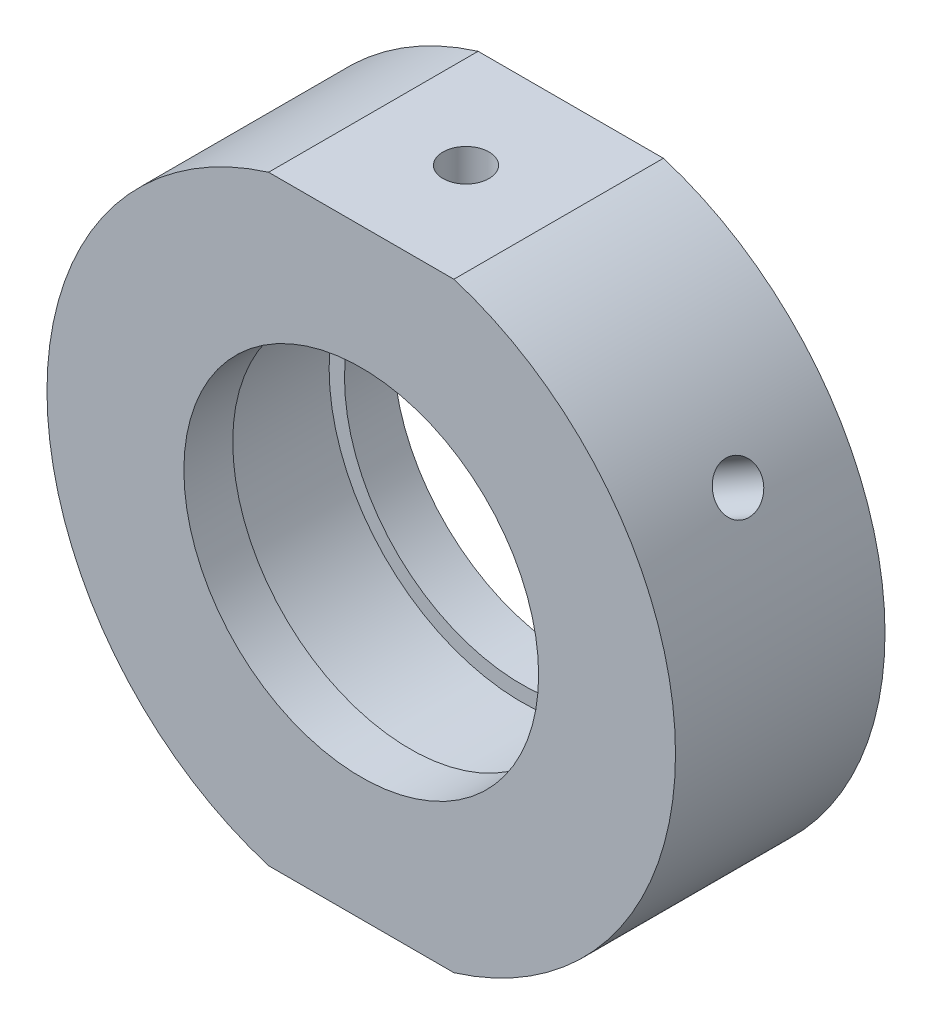
ISO-10303-21;
HEADER;
FILE_DESCRIPTION(('STEP AP214'),'2;1');
FILE_NAME('part.step','',(''),(''),'','','');
FILE_SCHEMA(('AUTOMOTIVE_DESIGN { 1 0 10303 214 1 1 1 1 }'));
ENDSEC;
DATA;
#1=APPLICATION_CONTEXT('core data for automotive mechanical design processes');
#2=APPLICATION_PROTOCOL_DEFINITION('international standard','automotive_design',2000,#1);
#3=PRODUCT_CONTEXT('',#1,'mechanical');
#4=PRODUCT('Part','Part','',(#3));
#5=PRODUCT_RELATED_PRODUCT_CATEGORY('part','',(#4));
#6=PRODUCT_DEFINITION_FORMATION('','',#4);
#7=PRODUCT_DEFINITION_CONTEXT('part definition',#1,'design');
#8=PRODUCT_DEFINITION('design','',#6,#7);
#9=PRODUCT_DEFINITION_SHAPE('','',#8);
#10=(LENGTH_UNIT() NAMED_UNIT(*) SI_UNIT(.MILLI.,.METRE.));
#11=(NAMED_UNIT(*) PLANE_ANGLE_UNIT() SI_UNIT($,.RADIAN.));
#12=(NAMED_UNIT(*) SI_UNIT($,.STERADIAN.) SOLID_ANGLE_UNIT());
#13=UNCERTAINTY_MEASURE_WITH_UNIT(LENGTH_MEASURE(1.E-05),#10,'distance_accuracy_value','');
#14=(GEOMETRIC_REPRESENTATION_CONTEXT(3) GLOBAL_UNCERTAINTY_ASSIGNED_CONTEXT((#13)) GLOBAL_UNIT_ASSIGNED_CONTEXT((#10,
#11,#12)) REPRESENTATION_CONTEXT('',''));
#15=CARTESIAN_POINT('',(0.,0.,0.));
#16=DIRECTION('',(0.,0.,1.));
#17=DIRECTION('',(1.,0.,0.));
#18=AXIS2_PLACEMENT_3D('',#15,#16,#17);
#19=CARTESIAN_POINT('',(0.,0.,-31.9390681003584));
#20=DIRECTION('',(0.,0.,-1.));
#21=DIRECTION('',(-1.,0.,0.));
#22=AXIS2_PLACEMENT_3D('',#19,#20,#21);
#23=CYLINDRICAL_SURFACE('',#22,22.5);
#24=CARTESIAN_POINT('',(18.6081064166282,12.6486511370754,0.));
#25=CARTESIAN_POINT('',(18.6081091445684,12.6486480256482,-0.0925474329693969));
#26=CARTESIAN_POINT('',(18.6125138731054,12.6421746060188,-0.185158797993222));
#27=CARTESIAN_POINT('',(18.6299798982569,12.6164211140759,-0.367821778925524));
#28=CARTESIAN_POINT('',(18.6430511412805,12.5971263268431,-0.457870329547935));
#29=CARTESIAN_POINT('',(18.6773484874938,12.5462181514554,-0.632735502702778));
#30=CARTESIAN_POINT('',(18.6985701317453,12.5146114987667,-0.717554956586452));
#31=CARTESIAN_POINT('',(18.7483705133498,12.4398798069712,-0.879593161075862));
#32=CARTESIAN_POINT('',(18.7769476202604,12.3967573204329,-0.956813590875986));
#33=CARTESIAN_POINT('',(18.840477972399,12.2999892619801,-1.10163881703034));
#34=CARTESIAN_POINT('',(18.8754425139885,12.2463250338274,-1.16922619396582));
#35=CARTESIAN_POINT('',(18.9504770478214,12.1298889730782,-1.29271735635595));
#36=CARTESIAN_POINT('',(18.9905472577464,12.0671167521442,-1.34862064338773));
#37=CARTESIAN_POINT('',(19.07446798279,11.9340210276433,-1.44721277784652));
#38=CARTESIAN_POINT('',(19.1183226577038,11.8636891933369,-1.48988684129189));
#39=CARTESIAN_POINT('',(19.2083253709266,11.7174060079341,-1.5607145737147));
#40=CARTESIAN_POINT('',(19.2544733771349,11.6414547354878,-1.58886844587412));
#41=CARTESIAN_POINT('',(19.3475192982386,11.4861513129805,-1.62980725829498));
#42=CARTESIAN_POINT('',(19.3944157002347,11.4068055848838,-1.64261999697985));
#43=CARTESIAN_POINT('',(19.4876355704773,11.2468053630823,-1.6525987260887));
#44=CARTESIAN_POINT('',(19.5339590472064,11.1661508887956,-1.64976494845143));
#45=CARTESIAN_POINT('',(19.6246406113247,11.0059954395026,-1.62855391604838));
#46=CARTESIAN_POINT('',(19.6690023064095,10.9264925447827,-1.61020655797746));
#47=CARTESIAN_POINT('',(19.7546955894407,10.7707894098273,-1.55853561861861));
#48=CARTESIAN_POINT('',(19.7960271541274,10.6945891949455,-1.52521192238447));
#49=CARTESIAN_POINT('',(19.8746995530709,10.5476668656687,-1.44450064779261));
#50=CARTESIAN_POINT('',(19.9120365178796,10.4769500808296,-1.39709959793996));
#51=CARTESIAN_POINT('',(19.9818442622882,10.3431910402597,-1.28958894618785));
#52=CARTESIAN_POINT('',(20.0143149658083,10.2801489045181,-1.22947914563367));
#53=CARTESIAN_POINT('',(20.0737952183103,10.1635156871738,-1.0980886080938));
#54=CARTESIAN_POINT('',(20.100791731849,10.1099472026106,-1.02678190789847));
#55=CARTESIAN_POINT('',(20.1487122328776,10.0141038458676,-0.875112433168419));
#56=CARTESIAN_POINT('',(20.1696362168436,9.97182898024142,-0.794749653378649));
#57=CARTESIAN_POINT('',(20.205038001384,9.89990173888359,-0.627231799011876));
#58=CARTESIAN_POINT('',(20.2195152453322,9.8702504531101,-0.540076138685324));
#59=CARTESIAN_POINT('',(20.2417722885586,9.82452578610739,-0.361454702097415));
#60=CARTESIAN_POINT('',(20.2495521965543,9.80845218447225,-0.269988995826284));
#61=CARTESIAN_POINT('',(20.258274922367,9.79042385713739,-0.0855717453532621));
#62=CARTESIAN_POINT('',(20.2592336113308,9.78843635690037,0.00737584507742665));
#63=CARTESIAN_POINT('',(20.2543401566944,9.79855781161291,0.192318706517118));
#64=CARTESIAN_POINT('',(20.2484880621061,9.81066666512193,0.284313984374369));
#65=CARTESIAN_POINT('',(20.2300801750725,9.84856814906699,0.464637354526802));
#66=CARTESIAN_POINT('',(20.2175318060138,9.87434562647747,0.552969391196749));
#67=CARTESIAN_POINT('',(20.1859477022425,9.93875215344416,0.723580817174414));
#68=CARTESIAN_POINT('',(20.1669118866491,9.97738136322621,0.805860131005674));
#69=CARTESIAN_POINT('',(20.1226460814815,10.0663587744469,0.962197030704582));
#70=CARTESIAN_POINT('',(20.0974047384709,10.1167284469958,1.03623918134707));
#71=CARTESIAN_POINT('',(20.041216547991,10.2275847935208,1.17384423356218));
#72=CARTESIAN_POINT('',(20.0102696242295,10.2880716027774,1.23740699498778));
#73=CARTESIAN_POINT('',(19.9432258782672,10.4174396710959,1.35237226215219));
#74=CARTESIAN_POINT('',(19.9071192959401,10.4863368024656,1.40375121940241));
#75=CARTESIAN_POINT('',(19.8305892755154,10.6303513254849,1.49272907232273));
#76=CARTESIAN_POINT('',(19.7901658721171,10.7054686671345,1.53032807874736));
#77=CARTESIAN_POINT('',(19.7060041346141,10.8596085369863,1.59063802031532));
#78=CARTESIAN_POINT('',(19.6622691299982,10.9386271157728,1.6133636930902));
#79=CARTESIAN_POINT('',(19.5725744712361,11.0983202133646,1.64333006917298));
#80=CARTESIAN_POINT('',(19.5266148487718,11.1789947085778,1.65057099294087));
#81=CARTESIAN_POINT('',(19.4338528524192,11.3394856253427,1.64936000000076));
#82=CARTESIAN_POINT('',(19.3870527086449,11.4193036159577,1.64094485988714));
#83=CARTESIAN_POINT('',(19.2938793172293,11.5760328158076,1.60873708167541));
#84=CARTESIAN_POINT('',(19.2475060702652,11.6529440204321,1.58494441918767));
#85=CARTESIAN_POINT('',(19.1566247729265,11.8017513342008,1.5226658321736));
#86=CARTESIAN_POINT('',(19.1121166695317,11.8736475859431,1.48418032563337));
#87=CARTESIAN_POINT('',(19.026407568677,12.0105096932139,1.3936130634051));
#88=CARTESIAN_POINT('',(18.9852065017649,12.0754756942968,1.34153159334872));
#89=CARTESIAN_POINT('',(18.9074120572343,12.1969254809359,1.22511337740371));
#90=CARTESIAN_POINT('',(18.8708291274807,12.2533900869802,1.16074964197884));
#91=CARTESIAN_POINT('',(18.8036530534932,12.356229828851,1.02163803597587));
#92=CARTESIAN_POINT('',(18.7730613696655,12.402602505008,0.946887641152488));
#93=CARTESIAN_POINT('',(18.7189456282168,12.4841291265489,0.789010610321112));
#94=CARTESIAN_POINT('',(18.6954325517637,12.5192656462871,0.705871224345826));
#95=CARTESIAN_POINT('',(18.6564373501344,12.5773041367646,0.533727595219881));
#96=CARTESIAN_POINT('',(18.6409459029528,12.6002203098041,0.444730295840865));
#97=CARTESIAN_POINT('',(18.6225688134722,12.6273545779087,0.295998114789599));
#98=CARTESIAN_POINT('',(18.6171544845495,12.6353314542287,0.237222396173702));
#99=CARTESIAN_POINT('',(18.609922412802,12.6459807287083,0.118973259243221));
#100=CARTESIAN_POINT('',(18.6081046628031,12.6486531374489,0.0594998423205809));
#101=CARTESIAN_POINT('',(18.6081064166282,12.6486511370754,0.));
#102=B_SPLINE_CURVE_WITH_KNOTS('',3,(#24,#25,#26,#27,#28,#29,#30,#31,#32,#33,#34,#35,#36,#37,
#38,#39,#40,#41,#42,#43,#44,#45,#46,#47,#48,#49,#50,#51,#52,#53,#54,#55,#56,#57,#58,#59,#60,#61,
#62,#63,#64,#65,#66,#67,#68,#69,#70,#71,#72,#73,#74,#75,#76,#77,#78,#79,#80,#81,#82,#83,#84,#85,
#86,#87,#88,#89,#90,#91,#92,#93,#94,#95,#96,#97,#98,#99,#100,#101),.UNSPECIFIED.,.T.,.F.,(4,2,2,
2,2,2,2,2,2,2,2,2,2,2,2,2,2,2,2,2,2,2,2,2,2,2,2,2,2,2,2,2,2,2,2,2,2,2,4),(0.,0.277425071517473,
0.555169091422678,0.832761378506566,1.11029218623785,1.38831865220752,1.66635697588088,
1.9447049033494,2.22304893577176,2.50088783654439,2.77872261873662,3.05602319414026,
3.3333258979145,3.6108948296993,3.88846810057741,4.16669477670939,4.44492161429148,
4.72317246995164,5.00141880869168,5.2790175304976,5.55661425465307,5.83390387672884,
6.1111969559747,6.38900118741266,6.66680913378801,6.9451497206928,7.22348807042255,
7.50155020207246,7.77960837486029,8.05701420466064,8.33442047444348,8.6118188530837,
8.88921140445146,9.16722067860601,9.445297635254,9.7238037805995,10.0019855410231,
10.1803457656965,10.3587056345923),.UNSPECIFIED.);
#103=CARTESIAN_POINT('',(18.6081064166282,12.6486511370754,0.));
#104=VERTEX_POINT('',#103);
#105=EDGE_CURVE('E11',#104,#104,#102,.T.);
#106=ORIENTED_EDGE('',*,*,#105,.T.);
#107=EDGE_LOOP('',(#106));
#108=FACE_BOUND('',#107,.T.);
#109=CARTESIAN_POINT('',(0.,0.,7.49999999999999));
#110=DIRECTION('',(0.,0.,-1.));
#111=DIRECTION('',(-1.,0.,0.));
#112=AXIS2_PLACEMENT_3D('',#109,#110,#111);
#113=CIRCLE('',#112,22.5);
#114=CARTESIAN_POINT('',(6.63324958071081,21.5,7.5));
#115=VERTEX_POINT('',#114);
#116=CARTESIAN_POINT('',(6.63324958071082,-21.5,7.49999999999999));
#117=VERTEX_POINT('',#116);
#118=EDGE_CURVE('E144',#115,#117,#113,.T.);
#119=ORIENTED_EDGE('',*,*,#118,.T.);
#120=DIRECTION('',(0.,0.,-1.));
#121=VECTOR('',#120,1.);
#122=CARTESIAN_POINT('',(6.63324958071083,-21.5,-31.9390681003584));
#123=LINE('',#122,#121);
#124=CARTESIAN_POINT('',(6.6332495807108,-21.5,-7.5));
#125=VERTEX_POINT('',#124);
#126=EDGE_CURVE('E57',#117,#125,#123,.T.);
#127=ORIENTED_EDGE('',*,*,#126,.T.);
#128=CARTESIAN_POINT('',(0.,0.,-7.5));
#129=DIRECTION('',(0.,0.,-1.));
#130=DIRECTION('',(-1.,0.,0.));
#131=AXIS2_PLACEMENT_3D('',#128,#129,#130);
#132=CIRCLE('',#131,22.5);
#133=CARTESIAN_POINT('',(6.63324958071083,21.5,-7.5));
#134=VERTEX_POINT('',#133);
#135=EDGE_CURVE('E148',#134,#125,#132,.T.);
#136=ORIENTED_EDGE('',*,*,#135,.F.);
#137=DIRECTION('',(0.,0.,-1.));
#138=VECTOR('',#137,1.);
#139=CARTESIAN_POINT('',(6.63324958071083,21.5,-31.9390681003584));
#140=LINE('',#139,#138);
#141=EDGE_CURVE('E118',#134,#115,#140,.F.);
#142=ORIENTED_EDGE('',*,*,#141,.T.);
#143=EDGE_LOOP('',(#119,#127,#136,#142));
#144=FACE_BOUND('',#143,.T.);
#145=ADVANCED_FACE('F37',(#108,#144),#23,.T.);
#146=CARTESIAN_POINT('',(12.7,0.,-7.5));
#147=DIRECTION('',(0.,0.,1.));
#148=DIRECTION('',(1.,0.,0.));
#149=AXIS2_PLACEMENT_3D('',#146,#147,#148);
#150=PLANE('',#149);
#151=CARTESIAN_POINT('',(0.,0.,-7.5));
#152=DIRECTION('',(0.,0.,-1.));
#153=DIRECTION('',(-1.,0.,0.));
#154=AXIS2_PLACEMENT_3D('',#151,#152,#153);
#155=CIRCLE('',#154,12.7);
#156=CARTESIAN_POINT('',(-12.7,0.,-7.5));
#157=VERTEX_POINT('',#156);
#158=EDGE_CURVE('E126',#157,#157,#155,.T.);
#159=ORIENTED_EDGE('',*,*,#158,.F.);
#160=EDGE_LOOP('',(#159));
#161=FACE_BOUND('',#160,.T.);
#162=ORIENTED_EDGE('',*,*,#135,.T.);
#163=DIRECTION('',(-1.,0.,0.));
#164=VECTOR('',#163,1.);
#165=CARTESIAN_POINT('',(12.7,-21.5,-7.5));
#166=LINE('',#165,#164);
#167=CARTESIAN_POINT('',(-6.63324958071082,-21.5,-7.5));
#168=VERTEX_POINT('',#167);
#169=EDGE_CURVE('E114',#125,#168,#166,.T.);
#170=ORIENTED_EDGE('',*,*,#169,.T.);
#171=CARTESIAN_POINT('',(-6.6332495807108,21.5,-7.5));
#172=VERTEX_POINT('',#171);
#173=EDGE_CURVE('E147',#168,#172,#132,.T.);
#174=ORIENTED_EDGE('',*,*,#173,.T.);
#175=DIRECTION('',(1.,0.,0.));
#176=VECTOR('',#175,1.);
#177=CARTESIAN_POINT('',(12.7,21.5,-7.5));
#178=LINE('',#177,#176);
#179=EDGE_CURVE('E121',#172,#134,#178,.T.);
#180=ORIENTED_EDGE('',*,*,#179,.T.);
#181=EDGE_LOOP('',(#162,#170,#174,#180));
#182=FACE_BOUND('',#181,.T.);
#183=ADVANCED_FACE('F39',(#161,#182),#150,.F.);
#184=CARTESIAN_POINT('',(-20.2581064166282,9.79076730458677,0.));
#185=CARTESIAN_POINT('',(-20.2581050860233,9.79077122276591,-0.0925474329693969));
#186=CARTESIAN_POINT('',(-20.2547013044435,9.79782253939038,-0.185158797993223));
#187=CARTESIAN_POINT('',(-20.2411311387604,9.82582530684612,-0.367821778925524));
#188=CARTESIAN_POINT('',(-20.230956984368,9.84679272897999,-0.457870329547935));
#189=CARTESIAN_POINT('',(-20.2040178843286,9.90194918977701,-0.632735502702777));
#190=CARTESIAN_POINT('',(-20.1872565422973,9.9361309991532,-0.717554956586451));
#191=CARTESIAN_POINT('',(-20.147437189537,10.0166252406386,-0.879593161075861));
#192=CARTESIAN_POINT('',(-20.1243805741757,10.062934984459,-0.956813590875986));
#193=CARTESIAN_POINT('',(-20.07234215335,10.1663379125488,-1.10163881703034));
#194=CARTESIAN_POINT('',(-20.04334983929,10.2234502078733,-1.16922619396582));
#195=CARTESIAN_POINT('',(-19.9800305196811,10.3466500507084,-1.29271735635595));
#196=CARTESIAN_POINT('',(-19.9457032866627,10.4127379809054,-1.34862064338773));
#197=CARTESIAN_POINT('',(-19.8723993706316,10.5519633229476,-1.44721277784652));
#198=CARTESIAN_POINT('',(-19.8334175528845,10.6251085026509,-1.48988684129189));
#199=CARTESIAN_POINT('',(-19.7517339547905,10.7761947314127,-1.5607145737147));
#200=CARTESIAN_POINT('',(-19.7090322265064,10.8541357133462,-1.58886844587412));
#201=CARTESIAN_POINT('',(-19.6210584778723,11.0123675559942,-1.62980725829498));
#202=CARTESIAN_POINT('',(-19.5757912626568,11.0926538955173,-1.64261999697985));
#203=CARTESIAN_POINT('',(-19.4838369410869,11.2533847821856,-1.6525987260887));
#204=CARTESIAN_POINT('',(-19.4371498557903,11.333829326968,-1.64976494845143));
#205=CARTESIAN_POINT('',(-19.3437919502072,11.4924395897958,-1.62855391604838));
#206=CARTESIAN_POINT('',(-19.2971212712477,11.5706093920541,-1.61020655797746));
#207=CARTESIAN_POINT('',(-19.2051250424431,11.7226735195706,-1.55853561861861));
#208=CARTESIAN_POINT('',(-19.1597995029249,11.7965678120084,-1.52521192238447));
#209=CARTESIAN_POINT('',(-19.0718972328598,11.9381612727084,-1.44450064779261));
#210=CARTESIAN_POINT('',(-19.0293231831195,12.0058544251525,-1.39709959793996));
#211=CARTESIAN_POINT('',(-18.9483883282044,12.1331892254762,-1.28958894618785));
#212=CARTESIAN_POINT('',(-18.9100275889035,12.1928307474742,-1.22947914563367));
#213=CARTESIAN_POINT('',(-18.8387603860092,12.3026587658366,-1.0980886080938));
#214=CARTESIAN_POINT('',(-18.8058669743045,12.3528226746563,-1.02678190789847));
#215=CARTESIAN_POINT('',(-18.7468244430955,12.4422447242806,-0.87511243316842));
#216=CARTESIAN_POINT('',(-18.7206753275046,12.4815028587567,-0.794749653378649));
#217=CARTESIAN_POINT('',(-18.6760854015348,12.5481253241869,-0.627231799011876));
#218=CARTESIAN_POINT('',(-18.6576452567742,12.5754886281096,-0.540076138685325));
#219=CARTESIAN_POINT('',(-18.6291750551834,12.6176261264581,-0.361454702097416));
#220=CARTESIAN_POINT('',(-18.619144861835,12.6324005252391,-0.269988995826284));
#221=CARTESIAN_POINT('',(-18.6078932352816,12.6489687910505,-0.0855717453532622));
#222=CARTESIAN_POINT('',(-18.6066513540682,12.6507927901661,0.00737584507742638));
#223=CARTESIAN_POINT('',(-18.6129700636543,12.6414942067824,0.192318706517118));
#224=CARTESIAN_POINT('',(-18.6205305911097,12.630371717449,0.284313984374369));
#225=CARTESIAN_POINT('',(-18.6441502955304,12.5954792776754,0.464637354526802));
#226=CARTESIAN_POINT('',(-18.660200061284,12.5717233325893,0.552969391196749));
#227=CARTESIAN_POINT('',(-18.700185697921,12.5121674328842,0.723580817174414));
#228=CARTESIAN_POINT('',(-18.7241216671237,12.4763673281076,0.805860131005674));
#229=CARTESIAN_POINT('',(-18.77904546302,12.3935433107031,0.962197030704581));
#230=CARTESIAN_POINT('',(-18.8100462075224,12.3464988301558,1.03623918134707));
#231=CARTESIAN_POINT('',(-18.8779565245438,12.2424102565451,1.17384423356217));
#232=CARTESIAN_POINT('',(-18.9148661760731,12.1853660297703,1.23740699498777));
#233=CARTESIAN_POINT('',(-18.9933803366944,12.0626204084428,1.35237226215219));
#234=CARTESIAN_POINT('',(-19.0349937115448,11.9969026252189,1.40375121940241));
#235=CARTESIAN_POINT('',(-19.1214489367811,11.8586184218693,1.49272907232273));
#236=CARTESIAN_POINT('',(-19.1662907612152,11.7860520567941,1.53032807874736));
#237=CARTESIAN_POINT('',(-19.2576989354914,11.636095919164,1.59063802031532));
#238=CARTESIAN_POINT('',(-19.3042635297835,11.5587110047387,1.6133636930902));
#239=CARTESIAN_POINT('',(-19.397714479726,11.4011866028711,1.64333006917298));
#240=CARTESIAN_POINT('',(-19.4446008307859,11.3210471546621,1.65057099294087));
#241=CARTESIAN_POINT('',(-19.5372090436047,11.1604674509325,1.64936000000076));
#242=CARTESIAN_POINT('',(-19.5829333792692,11.0800283422158,1.64094485988714));
#243=CARTESIAN_POINT('',(-19.6720781521463,10.9209732183681,1.60873708167541));
#244=CARTESIAN_POINT('',(-19.7154985857046,10.842357206129,1.58494441918767));
#245=CARTESIAN_POINT('',(-19.7989288510279,10.6892480370204,1.5226658321736));
#246=CARTESIAN_POINT('',(-19.8389387797762,10.6147547629351,1.48418032563337));
#247=CARTESIAN_POINT('',(-19.9146102910609,10.472097450624,1.3936130634051));
#248=CARTESIAN_POINT('',(-19.9502719649249,10.4039332794737,1.34153159334872));
#249=CARTESIAN_POINT('',(-20.0165533431733,10.2758364209174,1.22511337740371));
#250=CARTESIAN_POINT('',(-20.0471616615455,10.2159223713837,1.16074964197884));
#251=CARTESIAN_POINT('',(-20.1026354535305,10.1063263138487,1.02163803597587));
#252=CARTESIAN_POINT('',(-20.1274995272101,10.0566468004307,0.946887641152488));
#253=CARTESIAN_POINT('',(-20.1710457818249,9.96901788282112,0.789010610321112));
#254=CARTESIAN_POINT('',(-20.1897183622922,9.93108670142256,0.705871224345825));
#255=CARTESIAN_POINT('',(-20.2204835686283,9.86829662094709,0.53372759521988));
#256=CARTESIAN_POINT('',(-20.2325838330473,9.84342254762667,0.444730295840865));
#257=CARTESIAN_POINT('',(-20.2468942537986,9.8139403872366,0.2959981147896));
#258=CARTESIAN_POINT('',(-20.2510952668732,9.80526300268508,0.237222396173703));
#259=CARTESIAN_POINT('',(-20.2567017732308,9.79367520758995,0.118973259243221));
#260=CARTESIAN_POINT('',(-20.2581072720899,9.79076478554293,0.0594998423205813));
#261=CARTESIAN_POINT('',(-20.2581064166282,9.79076730458677,0.));
#262=B_SPLINE_CURVE_WITH_KNOTS('',3,(#184,#185,#186,#187,#188,#189,#190,#191,#192,#193,#194,
#195,#196,#197,#198,#199,#200,#201,#202,#203,#204,#205,#206,#207,#208,#209,#210,#211,#212,#213,
#214,#215,#216,#217,#218,#219,#220,#221,#222,#223,#224,#225,#226,#227,#228,#229,#230,#231,#232,
#233,#234,#235,#236,#237,#238,#239,#240,#241,#242,#243,#244,#245,#246,#247,#248,#249,#250,#251,
#252,#253,#254,#255,#256,#257,#258,#259,#260,#261),.UNSPECIFIED.,.T.,.F.,(4,2,2,2,2,2,2,2,2,2,2,
2,2,2,2,2,2,2,2,2,2,2,2,2,2,2,2,2,2,2,2,2,2,2,2,2,2,2,4),(0.,0.277425071517473,
0.555169091422678,0.832761378506565,1.11029218623785,1.38831865220752,1.66635697588087,
1.9447049033494,2.22304893577176,2.50088783654439,2.77872261873662,3.05602319414026,
3.3333258979145,3.6108948296993,3.88846810057741,4.16669477670939,4.44492161429147,
4.72317246995164,5.00141880869168,5.2790175304976,5.55661425465307,5.83390387672884,
6.1111969559747,6.38900118741266,6.666809133788,6.9451497206928,7.22348807042255,
7.50155020207246,7.77960837486029,8.05701420466064,8.33442047444348,8.61181885308369,
8.88921140445146,9.167220678606,9.445297635254,9.7238037805995,10.0019855410231,
10.1803457656965,10.3587056345923),.UNSPECIFIED.);
#263=CARTESIAN_POINT('',(-20.2581064166282,9.79076730458677,0.));
#264=VERTEX_POINT('',#263);
#265=EDGE_CURVE('E172',#264,#264,#262,.T.);
#266=ORIENTED_EDGE('',*,*,#265,.T.);
#267=EDGE_LOOP('',(#266));
#268=FACE_BOUND('',#267,.T.);
#269=ORIENTED_EDGE('',*,*,#173,.F.);
#270=DIRECTION('',(0.,0.,-1.));
#271=VECTOR('',#270,1.);
#272=CARTESIAN_POINT('',(-6.63324958071083,-21.5,-31.9390681003584));
#273=LINE('',#272,#271);
#274=CARTESIAN_POINT('',(-6.63324958071081,-21.5,7.5));
#275=VERTEX_POINT('',#274);
#276=EDGE_CURVE('E112',#168,#275,#273,.F.);
#277=ORIENTED_EDGE('',*,*,#276,.T.);
#278=CARTESIAN_POINT('',(-6.63324958071081,21.5,7.49999999999999));
#279=VERTEX_POINT('',#278);
#280=EDGE_CURVE('E65',#275,#279,#113,.T.);
#281=ORIENTED_EDGE('',*,*,#280,.T.);
#282=DIRECTION('',(0.,0.,-1.));
#283=VECTOR('',#282,1.);
#284=CARTESIAN_POINT('',(-6.63324958071083,21.5,-31.9390681003584));
#285=LINE('',#284,#283);
#286=EDGE_CURVE('E124',#279,#172,#285,.T.);
#287=ORIENTED_EDGE('',*,*,#286,.T.);
#288=EDGE_LOOP('',(#269,#277,#281,#287));
#289=FACE_BOUND('',#288,.T.);
#290=ADVANCED_FACE('F157',(#268,#289),#23,.T.);
#291=CARTESIAN_POINT('',(22.5,0.,7.5));
#292=DIRECTION('',(0.,0.,-1.));
#293=DIRECTION('',(-1.,0.,0.));
#294=AXIS2_PLACEMENT_3D('',#291,#292,#293);
#295=PLANE('',#294);
#296=ORIENTED_EDGE('',*,*,#280,.F.);
#297=DIRECTION('',(1.,0.,0.));
#298=VECTOR('',#297,1.);
#299=CARTESIAN_POINT('',(22.5,-21.5,7.5));
#300=LINE('',#299,#298);
#301=EDGE_CURVE('E50',#275,#117,#300,.T.);
#302=ORIENTED_EDGE('',*,*,#301,.T.);
#303=ORIENTED_EDGE('',*,*,#118,.F.);
#304=DIRECTION('',(-1.,0.,0.));
#305=VECTOR('',#304,1.);
#306=CARTESIAN_POINT('',(22.5,21.5,7.5));
#307=LINE('',#306,#305);
#308=EDGE_CURVE('E151',#115,#279,#307,.T.);
#309=ORIENTED_EDGE('',*,*,#308,.T.);
#310=EDGE_LOOP('',(#296,#302,#303,#309));
#311=FACE_BOUND('',#310,.T.);
#312=CARTESIAN_POINT('',(0.,0.,7.5));
#313=DIRECTION('',(0.,0.,-1.));
#314=DIRECTION('',(-1.,0.,0.));
#315=AXIS2_PLACEMENT_3D('',#312,#313,#314);
#316=CIRCLE('',#315,12.7);
#317=CARTESIAN_POINT('',(-12.7,0.,7.5));
#318=VERTEX_POINT('',#317);
#319=EDGE_CURVE('E141',#318,#318,#316,.T.);
#320=ORIENTED_EDGE('',*,*,#319,.T.);
#321=EDGE_LOOP('',(#320));
#322=FACE_BOUND('',#321,.T.);
#323=ADVANCED_FACE('F190',(#311,#322),#295,.F.);
#324=CARTESIAN_POINT('',(0.,0.,-31.9390681003584));
#325=DIRECTION('',(0.,0.,-1.));
#326=DIRECTION('',(-1.,0.,0.));
#327=AXIS2_PLACEMENT_3D('',#324,#325,#326);
#328=CYLINDRICAL_SURFACE('',#327,12.7);
#329=ORIENTED_EDGE('',*,*,#319,.F.);
#330=EDGE_LOOP('',(#329));
#331=FACE_BOUND('',#330,.T.);
#332=CARTESIAN_POINT('',(0.,0.,4.));
#333=DIRECTION('',(0.,0.,-1.));
#334=DIRECTION('',(-1.,0.,0.));
#335=AXIS2_PLACEMENT_3D('',#332,#333,#334);
#336=CIRCLE('',#335,12.7);
#337=CARTESIAN_POINT('',(-12.7,0.,4.));
#338=VERTEX_POINT('',#337);
#339=EDGE_CURVE('E138',#338,#338,#336,.T.);
#340=ORIENTED_EDGE('',*,*,#339,.T.);
#341=EDGE_LOOP('',(#340));
#342=FACE_BOUND('',#341,.T.);
#343=ADVANCED_FACE('F187',(#331,#342),#328,.F.);
#344=CARTESIAN_POINT('',(12.7,0.,4.));
#345=DIRECTION('',(0.,0.,1.));
#346=DIRECTION('',(1.,0.,0.));
#347=AXIS2_PLACEMENT_3D('',#344,#345,#346);
#348=PLANE('',#347);
#349=ORIENTED_EDGE('',*,*,#339,.F.);
#350=EDGE_LOOP('',(#349));
#351=FACE_BOUND('',#350,.T.);
#352=CARTESIAN_POINT('',(0.,0.,4.));
#353=DIRECTION('',(0.,0.,-1.));
#354=DIRECTION('',(-1.,0.,0.));
#355=AXIS2_PLACEMENT_3D('',#352,#353,#354);
#356=CIRCLE('',#355,13.8);
#357=CARTESIAN_POINT('',(-13.8,0.,4.));
#358=VERTEX_POINT('',#357);
#359=EDGE_CURVE('E135',#358,#358,#356,.T.);
#360=ORIENTED_EDGE('',*,*,#359,.T.);
#361=EDGE_LOOP('',(#360));
#362=FACE_BOUND('',#361,.T.);
#363=ADVANCED_FACE('F181',(#351,#362),#348,.F.);
#364=CARTESIAN_POINT('',(0.,0.,-31.9390681003584));
#365=DIRECTION('',(0.,0.,-1.));
#366=DIRECTION('',(-1.,0.,0.));
#367=AXIS2_PLACEMENT_3D('',#364,#365,#366);
#368=CYLINDRICAL_SURFACE('',#367,13.8);
#369=CARTESIAN_POINT('',(-12.6904171860917,5.42155989019299,0.));
#370=CARTESIAN_POINT('',(-12.6904163183257,5.42156394345343,0.0923251273429525));
#371=CARTESIAN_POINT('',(-12.6873465096964,5.42876501893527,0.184708749069935));
#372=CARTESIAN_POINT('',(-12.6750808410757,5.45733983731395,0.366907231732642));
#373=CARTESIAN_POINT('',(-12.6658784969898,5.47872858110291,0.45671926872211));
#374=CARTESIAN_POINT('',(-12.6414214634227,5.5349251596461,0.631110131580167));
#375=CARTESIAN_POINT('',(-12.6261707778716,5.56972411656817,0.715692376777816));
#376=CARTESIAN_POINT('',(-12.5897530904225,5.65155849607827,0.877302718779457));
#377=CARTESIAN_POINT('',(-12.5685871383666,5.69859174721968,0.954332152783317));
#378=CARTESIAN_POINT('',(-12.5204458268739,5.80360042862396,1.0990620322351));
#379=CARTESIAN_POINT('',(-12.4934442992696,5.86162499696361,1.16671812606062));
#380=CARTESIAN_POINT('',(-12.4340324016525,5.98661982371343,1.29039797120313));
#381=CARTESIAN_POINT('',(-12.4016217679167,6.05359051826346,1.34642115505429));
#382=CARTESIAN_POINT('',(-12.3317943772524,6.1945981555197,1.44540282233315));
#383=CARTESIAN_POINT('',(-12.2943627989467,6.26865582539509,1.48832134363824));
#384=CARTESIAN_POINT('',(-12.2152887910137,6.4213788058062,1.55961950537711));
#385=CARTESIAN_POINT('',(-12.17364650501,6.50004395914623,1.58799964150224));
#386=CARTESIAN_POINT('',(-12.0873091927324,6.65921243552076,1.62928339762863));
#387=CARTESIAN_POINT('',(-12.0426297658439,6.73970513281481,1.64226059286828));
#388=CARTESIAN_POINT('',(-11.9512082413986,6.90051985368736,1.65259802703745));
#389=CARTESIAN_POINT('',(-11.9044662185301,6.98084188333563,1.64995883098845));
#390=CARTESIAN_POINT('',(-11.8105255217195,7.13861869225054,1.62919754186424));
#391=CARTESIAN_POINT('',(-11.7633303980721,7.21608601762954,1.61115457346918));
#392=CARTESIAN_POINT('',(-11.6697355696176,7.36648643564844,1.56022150197969));
#393=CARTESIAN_POINT('',(-11.6233358788494,7.43941944831918,1.52733113711447));
#394=CARTESIAN_POINT('',(-11.5327824296484,7.57904202294379,1.44755215154001));
#395=CARTESIAN_POINT('',(-11.4886345104209,7.64571569547935,1.40062910732446));
#396=CARTESIAN_POINT('',(-11.4042831614964,7.77097397743574,1.29414176495503));
#397=CARTESIAN_POINT('',(-11.3640798974548,7.82955824718455,1.234576936242));
#398=CARTESIAN_POINT('',(-11.2888914978302,7.93758757106362,1.10405324888688));
#399=CARTESIAN_POINT('',(-11.2539405691346,7.98697317671015,1.03302546122534));
#400=CARTESIAN_POINT('',(-11.1909520099903,8.07499423450666,0.881829375690111));
#401=CARTESIAN_POINT('',(-11.1629143980246,8.11362965791559,0.801661053379626));
#402=CARTESIAN_POINT('',(-11.1149115456465,8.17926668466028,0.634400455600413));
#403=CARTESIAN_POINT('',(-11.0949492782134,8.20626400360803,0.547305644203878));
#404=CARTESIAN_POINT('',(-11.0639792260675,8.24797215480043,0.368694771766221));
#405=CARTESIAN_POINT('',(-11.0529710476846,8.2626835272023,0.277178905285958));
#406=CARTESIAN_POINT('',(-11.0404378579819,8.27942283526434,0.0929286209666899));
#407=CARTESIAN_POINT('',(-11.0388547212236,8.28152851231143,0.000205213880280202));
#408=CARTESIAN_POINT('',(-11.0450866609989,8.27321500862395,-0.184358410071627));
#409=CARTESIAN_POINT('',(-11.0529015546516,8.26279607161218,-0.27619864408818));
#410=CARTESIAN_POINT('',(-11.0775443874021,8.22972836953299,-0.456101928759155));
#411=CARTESIAN_POINT('',(-11.0943446175904,8.2071172010265,-0.544175697440953));
#412=CARTESIAN_POINT('',(-11.1362169503866,8.15020936485069,-0.71438075651537));
#413=CARTESIAN_POINT('',(-11.1612893201051,8.11591231983878,-0.796511854912463));
#414=CARTESIAN_POINT('',(-11.2188038832685,8.03622153846956,-0.952937035783408));
#415=CARTESIAN_POINT('',(-11.2512811638944,7.99077489065355,-1.02719125759573));
#416=CARTESIAN_POINT('',(-11.3222335317442,7.88991886908661,-1.16534876067103));
#417=CARTESIAN_POINT('',(-11.3607088320698,7.83450914134974,-1.22925167400098));
#418=CARTESIAN_POINT('',(-11.4423957222252,7.71471665037146,-1.34522972640857));
#419=CARTESIAN_POINT('',(-11.4856308995709,7.65028872720719,-1.39724163548001));
#420=CARTESIAN_POINT('',(-11.5750766615814,7.51426754002918,-1.48752431239441));
#421=CARTESIAN_POINT('',(-11.6212871906589,7.44267440986651,-1.52579533686545));
#422=CARTESIAN_POINT('',(-11.7149490537318,7.29435643172237,-1.58740481096939));
#423=CARTESIAN_POINT('',(-11.7623970131512,7.21764479986392,-1.61078019001394));
#424=CARTESIAN_POINT('',(-11.8570877095649,7.06100854820119,-1.64205506539082));
#425=CARTESIAN_POINT('',(-11.9043304549078,6.98108406048405,-1.64995519727985));
#426=CARTESIAN_POINT('',(-11.9968908897721,6.82078605024646,-1.6500441460245));
#427=CARTESIAN_POINT('',(-12.0422187452533,6.7404184343338,-1.64233061357805));
#428=CARTESIAN_POINT('',(-12.1300381053064,6.58106792233546,-1.61161752866926));
#429=CARTESIAN_POINT('',(-12.1725296107226,6.50208502583759,-1.58861798075703));
#430=CARTESIAN_POINT('',(-12.2536598301213,6.34786709067746,-1.52801558102713));
#431=CARTESIAN_POINT('',(-12.2922996637058,6.27263096610617,-1.49041698849994));
#432=CARTESIAN_POINT('',(-12.3649649916914,6.1281472238918,-1.4016939105203));
#433=CARTESIAN_POINT('',(-12.3989904502435,6.0588996527752,-1.35056931999367));
#434=CARTESIAN_POINT('',(-12.4620496813093,5.92812182362781,-1.23588282703703));
#435=CARTESIAN_POINT('',(-12.4910523082727,5.86664031571741,-1.17224820577919));
#436=CARTESIAN_POINT('',(-12.5434223152981,5.75381924178566,-1.03449795589998));
#437=CARTESIAN_POINT('',(-12.5667883553563,5.7024820879375,-0.960379841634869));
#438=CARTESIAN_POINT('',(-12.607687110917,5.61148207527715,-0.803468004778813));
#439=CARTESIAN_POINT('',(-12.6251988820343,5.57186119002126,-0.720644497175926));
#440=CARTESIAN_POINT('',(-12.654096975566,5.50591841548263,-0.548932964323395));
#441=CARTESIAN_POINT('',(-12.6654900193757,5.47958193528029,-0.460051714971396));
#442=CARTESIAN_POINT('',(-12.6793245644264,5.44746857628439,-0.308916488087958));
#443=CARTESIAN_POINT('',(-12.6834821914084,5.43776882097767,-0.247619114097619));
#444=CARTESIAN_POINT('',(-12.6890287849085,5.42481313584722,-0.124223318270614));
#445=CARTESIAN_POINT('',(-12.690417770005,5.42155716278374,-0.0621249018120021));
#446=CARTESIAN_POINT('',(-12.6904171860917,5.42155989019299,0.));
#447=B_SPLINE_CURVE_WITH_KNOTS('',3,(#369,#370,#371,#372,#373,#374,#375,#376,#377,#378,#379,
#380,#381,#382,#383,#384,#385,#386,#387,#388,#389,#390,#391,#392,#393,#394,#395,#396,#397,#398,
#399,#400,#401,#402,#403,#404,#405,#406,#407,#408,#409,#410,#411,#412,#413,#414,#415,#416,#417,
#418,#419,#420,#421,#422,#423,#424,#425,#426,#427,#428,#429,#430,#431,#432,#433,#434,#435,#436,
#437,#438,#439,#440,#441,#442,#443,#444,#445,#446),.UNSPECIFIED.,.T.,.F.,(4,2,2,2,2,2,2,2,2,2,2,
2,2,2,2,2,2,2,2,2,2,2,2,2,2,2,2,2,2,2,2,2,2,2,2,2,2,2,4),(0.,0.276748449948136,
0.553789978717403,0.830648414601305,1.10745774478389,1.38553511147275,1.66362603988849,
1.94255671521477,2.22147787966838,2.49906128949227,2.77663465604641,3.05279072939663,
3.32895167177688,3.60579569925361,3.8826513478099,4.16123846424234,4.43982632548177,
4.71851665712959,4.99719473538484,5.27415237509659,5.55110462543689,5.82720769587894,
6.10331968266731,6.38076822849225,6.65822663394912,6.93712777081639,7.2160236985877,
7.49422546713594,7.77241580990836,8.0488716756615,8.32532745912329,8.60170264677669,
8.87807998146172,9.15611407116348,9.43421419379908,9.71329886514741,9.9920763328512,
10.1782995869717,10.3645215914731),.UNSPECIFIED.);
#448=CARTESIAN_POINT('',(-12.6904171860917,5.42155989019299,0.));
#449=VERTEX_POINT('',#448);
#450=EDGE_CURVE('E41',#449,#449,#447,.T.);
#451=ORIENTED_EDGE('',*,*,#450,.T.);
#452=EDGE_LOOP('',(#451));
#453=FACE_BOUND('',#452,.T.);
#454=CARTESIAN_POINT('',(11.0404171860917,8.27944372268162,0.));
#455=CARTESIAN_POINT('',(11.0404202624352,8.27944094454404,0.0923251273429524));
#456=CARTESIAN_POINT('',(11.0451216724224,8.27318187454537,0.184708749069935));
#457=CARTESIAN_POINT('',(11.0637353567365,8.24827208473612,0.366907231732642));
#458=CARTESIAN_POINT('',(11.0776573801698,8.22960824908885,0.456719268722109));
#459=CARTESIAN_POINT('',(11.1140965280105,8.18032954744699,0.631110131580167));
#460=CARTESIAN_POINT('',(11.1366079659546,8.1497225878736,0.715692376777816));
#461=CARTESIAN_POINT('',(11.1892697737887,8.07726675564048,0.877302718779457));
#462=CARTESIAN_POINT('',(11.2194187880718,8.03541987789414,0.954332152783317));
#463=CARTESIAN_POINT('',(11.2862883180395,7.94122393846779,1.0990620322351));
#464=CARTESIAN_POINT('',(11.3230383044631,7.88882764545164,1.16671812606062));
#465=CARTESIAN_POINT('',(11.4015810509615,7.77487801945329,1.29039797120313));
#466=CARTESIAN_POINT('',(11.4433740568831,7.71332424001037,1.34642115505429));
#467=CARTESIAN_POINT('',(11.5305765575424,7.58234812718698,1.44540282233315));
#468=CARTESIAN_POINT('',(11.5759965918467,7.51290259453276,1.48832134363824));
#469=CARTESIAN_POINT('',(11.6687215686579,7.36806100467818,1.55961950537711));
#470=CARTESIAN_POINT('',(11.7160264468411,7.29266515045729,1.58799964150224));
#471=CARTESIAN_POINT('',(11.8107017347244,7.13831060654321,1.62928339762863));
#472=CARTESIAN_POINT('',(11.8580707419559,7.05937073918416,1.64226059286828));
#473=CARTESIAN_POINT('',(11.9516296133114,6.89979001612561,1.65259802703745));
#474=CARTESIAN_POINT('',(11.9978195200361,6.81914922207306,1.64995883098845));
#475=CARTESIAN_POINT('',(12.0874878962791,6.65890578772836,1.62919754186424));
#476=CARTESIAN_POINT('',(12.1309790061969,6.57929994902551,1.61115457346918));
#477=CARTESIAN_POINT('',(12.2144321747137,6.42304424091157,1.56022150197969));
#478=CARTESIAN_POINT('',(12.2543941710771,6.34639442364322,1.52733113711447));
#479=CARTESIAN_POINT('',(12.3300341430433,6.19816154892257,1.44755215154001));
#480=CARTESIAN_POINT('',(12.3657012776089,6.12659149307958,1.40062910732446));
#481=CARTESIAN_POINT('',(12.4320024573553,5.99091194108922,1.29414176495503));
#482=CARTESIAN_POINT('',(12.4626362911991,5.9268027582398,1.234576936242));
#483=CARTESIAN_POINT('',(12.5185982302197,5.80767303215539,1.10405324888688));
#484=CARTESIAN_POINT('',(12.5438919549431,5.75271183719591,1.03302546122534));
#485=CARTESIAN_POINT('',(12.5886261474907,5.6541516159309,0.88182937569011));
#486=CARTESIAN_POINT('',(12.608066599666,5.61055262000271,0.801661053379625));
#487=CARTESIAN_POINT('',(12.6409085060667,5.53616241701679,0.634400455600412));
#488=CARTESIAN_POINT('',(12.654307736393,5.50537592682873,0.547305644203878));
#489=CARTESIAN_POINT('',(12.6749430287975,5.45770099931763,0.368694771766221));
#490=CARTESIAN_POINT('',(12.6821793618306,5.44081195098771,0.277178905285957));
#491=CARTESIAN_POINT('',(12.6904094330028,5.42158823628377,0.0929286209666892));
#492=CARTESIAN_POINT('',(12.6914414344386,5.41916436110981,0.000205213880279361));
#493=CARTESIAN_POINT('',(12.6873576989385,5.42871813111386,-0.184358410071628));
#494=CARTESIAN_POINT('',(12.6822420816322,5.44069549605086,-0.276198644088181));
#495=CARTESIAN_POINT('',(12.6659260279621,5.47857066627355,-0.456101928759156));
#496=CARTESIAN_POINT('',(12.6547442967203,5.50442567665932,-0.544175697440954));
#497=CARTESIAN_POINT('',(12.6263968313158,5.56914209866446,-0.714380756515372));
#498=CARTESIAN_POINT('',(12.60923090392,5.60800393027966,-0.796511854912464));
#499=CARTESIAN_POINT('',(12.5689739443885,5.6976583937514,-0.952937035783409));
#500=CARTESIAN_POINT('',(12.545854633176,5.74850786772727,-1.02719125759574));
#501=CARTESIAN_POINT('',(12.4939869402992,5.86038243152727,-1.16534876067103));
#502=CARTESIAN_POINT('',(12.4652383586251,5.92140788289596,-1.22925167400098));
#503=CARTESIAN_POINT('',(12.402338463333,6.05204705041579,-1.34522972640857));
#504=CARTESIAN_POINT('',(12.3681598338325,6.12170377391641,-1.39724163548001));
#505=CARTESIAN_POINT('',(12.2950849112887,6.26717666966741,-1.48752431239441));
#506=CARTESIAN_POINT('',(12.2561887063701,6.34299272685214,-1.52579533686545));
#507=CARTESIAN_POINT('',(12.1745725009958,6.49826526871114,-1.58740481096939));
#508=CARTESIAN_POINT('',(12.1318622587503,6.57771222285528,-1.61078019001394));
#509=CARTESIAN_POINT('',(12.0435566338637,6.738034897283,-1.64205506539082));
#510=CARTESIAN_POINT('',(11.9979613697876,6.818910558753,-1.64995519727985));
#511=CARTESIAN_POINT('',(11.905419438178,6.97921925184965,-1.6500441460245));
#512=CARTESIAN_POINT('',(11.8584829688966,7.05865813415178,-1.64233061357805));
#513=CARTESIAN_POINT('',(11.7643910574265,7.21438718690103,-1.61161752866926));
#514=CARTESIAN_POINT('',(11.717235615303,7.2906773582854,-1.58861798075703));
#515=CARTESIAN_POINT('',(11.6242440754345,7.43804715687932,-1.52801558102713));
#516=CARTESIAN_POINT('',(11.5784075970657,7.50912829664714,-1.49041698849994));
#517=CARTESIAN_POINT('',(11.489613669867,7.64430018776418,-1.4016939105203));
#518=CARTESIAN_POINT('',(11.4466562434057,7.708390884804,-1.35056931999367));
#519=CARTESIAN_POINT('',(11.3649289366452,7.82839069542383,-1.23588282703703));
#520=CARTESIAN_POINT('',(11.3261857024135,7.88424846110581,-1.17224820577918));
#521=CARTESIAN_POINT('',(11.2546647898191,7.98601275455204,-1.03449795589998));
#522=CARTESIAN_POINT('',(11.2218885304577,8.03191691575238,-0.960379841634868));
#523=CARTESIAN_POINT('',(11.1635295855294,8.11283628338125,-0.803468004778813));
#524=CARTESIAN_POINT('',(11.1379727779361,8.14781236466212,-0.720644497175925));
#525=CARTESIAN_POINT('',(11.0953137067554,8.20581023505076,-0.548932964323396));
#526=CARTESIAN_POINT('',(11.0782021677588,8.22884514051759,-0.460051714971396));
#527=CARTESIAN_POINT('',(11.0573084555929,8.25688288747928,-0.308916488087958));
#528=CARTESIAN_POINT('',(11.0509870345778,8.26533337571849,-0.247619114097619));
#529=CARTESIAN_POINT('',(11.0425403788814,8.27661470915924,-0.124223318270614));
#530=CARTESIAN_POINT('',(11.0404151160426,8.27944559207004,-0.0621249018120021));
#531=CARTESIAN_POINT('',(11.0404171860917,8.27944372268162,0.));
#532=B_SPLINE_CURVE_WITH_KNOTS('',3,(#454,#455,#456,#457,#458,#459,#460,#461,#462,#463,#464,
#465,#466,#467,#468,#469,#470,#471,#472,#473,#474,#475,#476,#477,#478,#479,#480,#481,#482,#483,
#484,#485,#486,#487,#488,#489,#490,#491,#492,#493,#494,#495,#496,#497,#498,#499,#500,#501,#502,
#503,#504,#505,#506,#507,#508,#509,#510,#511,#512,#513,#514,#515,#516,#517,#518,#519,#520,#521,
#522,#523,#524,#525,#526,#527,#528,#529,#530,#531),.UNSPECIFIED.,.T.,.F.,(4,2,2,2,2,2,2,2,2,2,2,
2,2,2,2,2,2,2,2,2,2,2,2,2,2,2,2,2,2,2,2,2,2,2,2,2,2,2,4),(0.,0.276748449948136,
0.553789978717403,0.830648414601306,1.10745774478388,1.38553511147275,1.66362603988849,
1.94255671521478,2.22147787966838,2.49906128949227,2.77663465604642,3.05279072939663,
3.32895167177688,3.60579569925362,3.8826513478099,4.16123846424234,4.43982632548177,
4.71851665712959,4.99719473538484,5.27415237509659,5.55110462543689,5.82720769587895,
6.10331968266731,6.38076822849226,6.65822663394912,6.93712777081639,7.2160236985877,
7.49422546713594,7.77241580990837,8.04887167566151,8.32532745912329,8.60170264677669,
8.87807998146172,9.15611407116348,9.43421419379908,9.71329886514741,9.9920763328512,
10.1782995869717,10.3645215914731),.UNSPECIFIED.);
#533=CARTESIAN_POINT('',(11.0404171860917,8.27944372268162,0.));
#534=VERTEX_POINT('',#533);
#535=EDGE_CURVE('E106',#534,#534,#532,.T.);
#536=ORIENTED_EDGE('',*,*,#535,.T.);
#537=EDGE_LOOP('',(#536));
#538=FACE_BOUND('',#537,.T.);
#539=ORIENTED_EDGE('',*,*,#359,.F.);
#540=EDGE_LOOP('',(#539));
#541=FACE_BOUND('',#540,.T.);
#542=CARTESIAN_POINT('',(0.,0.,-4.));
#543=DIRECTION('',(0.,0.,-1.));
#544=DIRECTION('',(-1.,0.,0.));
#545=AXIS2_PLACEMENT_3D('',#542,#543,#544);
#546=CIRCLE('',#545,13.8);
#547=CARTESIAN_POINT('',(-13.8,0.,-4.));
#548=VERTEX_POINT('',#547);
#549=EDGE_CURVE('E132',#548,#548,#546,.T.);
#550=ORIENTED_EDGE('',*,*,#549,.T.);
#551=EDGE_LOOP('',(#550));
#552=FACE_BOUND('',#551,.T.);
#553=ADVANCED_FACE('F175',(#453,#538,#541,#552),#368,.F.);
#554=CARTESIAN_POINT('',(13.8,0.,-4.));
#555=DIRECTION('',(0.,0.,-1.));
#556=DIRECTION('',(-1.,0.,0.));
#557=AXIS2_PLACEMENT_3D('',#554,#555,#556);
#558=PLANE('',#557);
#559=ORIENTED_EDGE('',*,*,#549,.F.);
#560=EDGE_LOOP('',(#559));
#561=FACE_BOUND('',#560,.T.);
#562=CARTESIAN_POINT('',(0.,0.,-4.00000000000001));
#563=DIRECTION('',(0.,0.,-1.));
#564=DIRECTION('',(-1.,0.,0.));
#565=AXIS2_PLACEMENT_3D('',#562,#563,#564);
#566=CIRCLE('',#565,12.7);
#567=CARTESIAN_POINT('',(-12.7,0.,-4.00000000000001));
#568=VERTEX_POINT('',#567);
#569=EDGE_CURVE('E129',#568,#568,#566,.T.);
#570=ORIENTED_EDGE('',*,*,#569,.T.);
#571=EDGE_LOOP('',(#570));
#572=FACE_BOUND('',#571,.T.);
#573=ADVANCED_FACE('F180',(#561,#572),#558,.F.);
#574=CARTESIAN_POINT('',(0.,0.,-31.9390681003584));
#575=DIRECTION('',(0.,0.,-1.));
#576=DIRECTION('',(-1.,0.,0.));
#577=AXIS2_PLACEMENT_3D('',#574,#575,#576);
#578=CYLINDRICAL_SURFACE('',#577,12.7);
#579=ORIENTED_EDGE('',*,*,#569,.F.);
#580=EDGE_LOOP('',(#579));
#581=FACE_BOUND('',#580,.T.);
#582=ORIENTED_EDGE('',*,*,#158,.T.);
#583=EDGE_LOOP('',(#582));
#584=FACE_BOUND('',#583,.T.);
#585=ADVANCED_FACE('F216',(#581,#584),#578,.F.);
#586=CARTESIAN_POINT('',(-33.1519726534682,21.5,-41.5));
#587=DIRECTION('',(0.,-1.,0.));
#588=DIRECTION('',(0.,0.,-1.));
#589=AXIS2_PLACEMENT_3D('',#586,#587,#588);
#590=PLANE('',#589);
#591=CARTESIAN_POINT('',(0.,21.5,0.));
#592=DIRECTION('',(0.,1.,0.));
#593=DIRECTION('',(0.,0.,1.));
#594=AXIS2_PLACEMENT_3D('',#591,#592,#593);
#595=CIRCLE('',#594,1.64999999999999);
#596=CARTESIAN_POINT('',(0.,21.5,1.64999999999999));
#597=VERTEX_POINT('',#596);
#598=EDGE_CURVE('E99',#597,#597,#595,.T.);
#599=ORIENTED_EDGE('',*,*,#598,.F.);
#600=EDGE_LOOP('',(#599));
#601=FACE_BOUND('',#600,.T.);
#602=ORIENTED_EDGE('',*,*,#308,.F.);
#603=ORIENTED_EDGE('',*,*,#141,.F.);
#604=ORIENTED_EDGE('',*,*,#179,.F.);
#605=ORIENTED_EDGE('',*,*,#286,.F.);
#606=EDGE_LOOP('',(#602,#603,#604,#605));
#607=FACE_BOUND('',#606,.T.);
#608=ADVANCED_FACE('F214',(#601,#607),#590,.F.);
#609=CARTESIAN_POINT('',(-33.1519726534682,-21.5,-41.5));
#610=DIRECTION('',(0.,1.,0.));
#611=DIRECTION('',(0.,0.,1.));
#612=AXIS2_PLACEMENT_3D('',#609,#610,#611);
#613=PLANE('',#612);
#614=CARTESIAN_POINT('',(0.,-21.5,0.));
#615=DIRECTION('',(0.,-1.,0.));
#616=DIRECTION('',(0.,0.,-1.));
#617=AXIS2_PLACEMENT_3D('',#614,#615,#616);
#618=CIRCLE('',#617,2.5);
#619=CARTESIAN_POINT('',(0.,-21.5,-2.5));
#620=VERTEX_POINT('',#619);
#621=EDGE_CURVE('E100',#620,#620,#618,.T.);
#622=ORIENTED_EDGE('',*,*,#621,.F.);
#623=EDGE_LOOP('',(#622));
#624=FACE_BOUND('',#623,.T.);
#625=ORIENTED_EDGE('',*,*,#301,.F.);
#626=ORIENTED_EDGE('',*,*,#276,.F.);
#627=ORIENTED_EDGE('',*,*,#169,.F.);
#628=ORIENTED_EDGE('',*,*,#126,.F.);
#629=EDGE_LOOP('',(#625,#626,#627,#628));
#630=FACE_BOUND('',#629,.T.);
#631=ADVANCED_FACE('F209',(#624,#630),#613,.F.);
#632=CARTESIAN_POINT('',(0.,16.,0.));
#633=DIRECTION('',(0.,1.,0.));
#634=DIRECTION('',(0.,0.,1.));
#635=AXIS2_PLACEMENT_3D('',#632,#633,#634);
#636=CONICAL_SURFACE('',#635,1.65,1.02974425867665);
#637=CARTESIAN_POINT('',(0.,15.0085799786045,0.));
#638=VERTEX_POINT('',#637);
#639=VERTEX_LOOP('',#638);
#640=FACE_BOUND('',#639,.T.);
#641=CARTESIAN_POINT('',(0.,16.,0.));
#642=DIRECTION('',(0.,1.,0.));
#643=DIRECTION('',(0.,0.,1.));
#644=AXIS2_PLACEMENT_3D('',#641,#642,#643);
#645=CIRCLE('',#644,1.65);
#646=CARTESIAN_POINT('',(0.,16.,1.65));
#647=VERTEX_POINT('',#646);
#648=EDGE_CURVE('E103',#647,#647,#645,.T.);
#649=ORIENTED_EDGE('',*,*,#648,.T.);
#650=EDGE_LOOP('',(#649));
#651=FACE_BOUND('',#650,.T.);
#652=ADVANCED_FACE('F223',(#640,#651),#636,.F.);
#653=CARTESIAN_POINT('',(0.,21.5,0.));
#654=DIRECTION('',(0.,1.,0.));
#655=DIRECTION('',(0.,0.,1.));
#656=AXIS2_PLACEMENT_3D('',#653,#654,#655);
#657=CYLINDRICAL_SURFACE('',#656,1.64999999999999);
#658=ORIENTED_EDGE('',*,*,#648,.F.);
#659=EDGE_LOOP('',(#658));
#660=FACE_BOUND('',#659,.T.);
#661=ORIENTED_EDGE('',*,*,#598,.T.);
#662=EDGE_LOOP('',(#661));
#663=FACE_BOUND('',#662,.T.);
#664=ADVANCED_FACE('F93',(#660,#663),#657,.F.);
#665=CARTESIAN_POINT('',(0.,-16.,0.));
#666=DIRECTION('',(0.,-1.,0.));
#667=DIRECTION('',(0.,0.,-1.));
#668=AXIS2_PLACEMENT_3D('',#665,#666,#667);
#669=CONICAL_SURFACE('',#668,2.5,1.02974425867665);
#670=CARTESIAN_POINT('',(0.,-14.4978484524311,0.));
#671=VERTEX_POINT('',#670);
#672=VERTEX_LOOP('',#671);
#673=FACE_BOUND('',#672,.T.);
#674=CARTESIAN_POINT('',(0.,-16.,0.));
#675=DIRECTION('',(0.,-1.,0.));
#676=DIRECTION('',(0.,0.,-1.));
#677=AXIS2_PLACEMENT_3D('',#674,#675,#676);
#678=CIRCLE('',#677,2.5);
#679=CARTESIAN_POINT('',(0.,-16.,-2.5));
#680=VERTEX_POINT('',#679);
#681=EDGE_CURVE('E97',#680,#680,#678,.T.);
#682=ORIENTED_EDGE('',*,*,#681,.T.);
#683=EDGE_LOOP('',(#682));
#684=FACE_BOUND('',#683,.T.);
#685=ADVANCED_FACE('F89',(#673,#684),#669,.F.);
#686=CARTESIAN_POINT('',(0.,-21.5,0.));
#687=DIRECTION('',(0.,-1.,0.));
#688=DIRECTION('',(0.,0.,-1.));
#689=AXIS2_PLACEMENT_3D('',#686,#687,#688);
#690=CYLINDRICAL_SURFACE('',#689,2.5);
#691=ORIENTED_EDGE('',*,*,#681,.F.);
#692=EDGE_LOOP('',(#691));
#693=FACE_BOUND('',#692,.T.);
#694=ORIENTED_EDGE('',*,*,#621,.T.);
#695=EDGE_LOOP('',(#694));
#696=FACE_BOUND('',#695,.T.);
#697=ADVANCED_FACE('F92',(#693,#696),#690,.F.);
#698=CARTESIAN_POINT('',(19.4855715851498,11.2500000000001,0.));
#699=DIRECTION('',(0.866025403784436,0.500000000000004,0.));
#700=DIRECTION('',(-0.500000000000004,0.866025403784436,0.));
#701=AXIS2_PLACEMENT_3D('',#698,#699,#700);
#702=CYLINDRICAL_SURFACE('',#701,1.64999999999999);
#703=ORIENTED_EDGE('',*,*,#105,.F.);
#704=EDGE_LOOP('',(#703));
#705=FACE_BOUND('',#704,.T.);
#706=ORIENTED_EDGE('',*,*,#535,.F.);
#707=EDGE_LOOP('',(#706));
#708=FACE_BOUND('',#707,.T.);
#709=ADVANCED_FACE('F160',(#705,#708),#702,.F.);
#710=CARTESIAN_POINT('',(-19.4855715851498,11.2500000000001,0.));
#711=DIRECTION('',(-0.866025403784436,0.500000000000004,0.));
#712=DIRECTION('',(-0.500000000000004,-0.866025403784437,0.));
#713=AXIS2_PLACEMENT_3D('',#710,#711,#712);
#714=CYLINDRICAL_SURFACE('',#713,1.64999999999999);
#715=ORIENTED_EDGE('',*,*,#450,.F.);
#716=EDGE_LOOP('',(#715));
#717=FACE_BOUND('',#716,.T.);
#718=ORIENTED_EDGE('',*,*,#265,.F.);
#719=EDGE_LOOP('',(#718));
#720=FACE_BOUND('',#719,.T.);
#721=ADVANCED_FACE('F164',(#717,#720),#714,.F.);
#722=CLOSED_SHELL('',(#145,#183,#290,#323,#343,#363,#553,#573,#585,#608,#631,#652,#664,#685,
#697,#709,#721));
#723=MANIFOLD_SOLID_BREP('B2',#722);
#724=ADVANCED_BREP_SHAPE_REPRESENTATION('',(#18,#723),#14);
#725=SHAPE_DEFINITION_REPRESENTATION(#9,#724);
ENDSEC;
END-ISO-10303-21;
